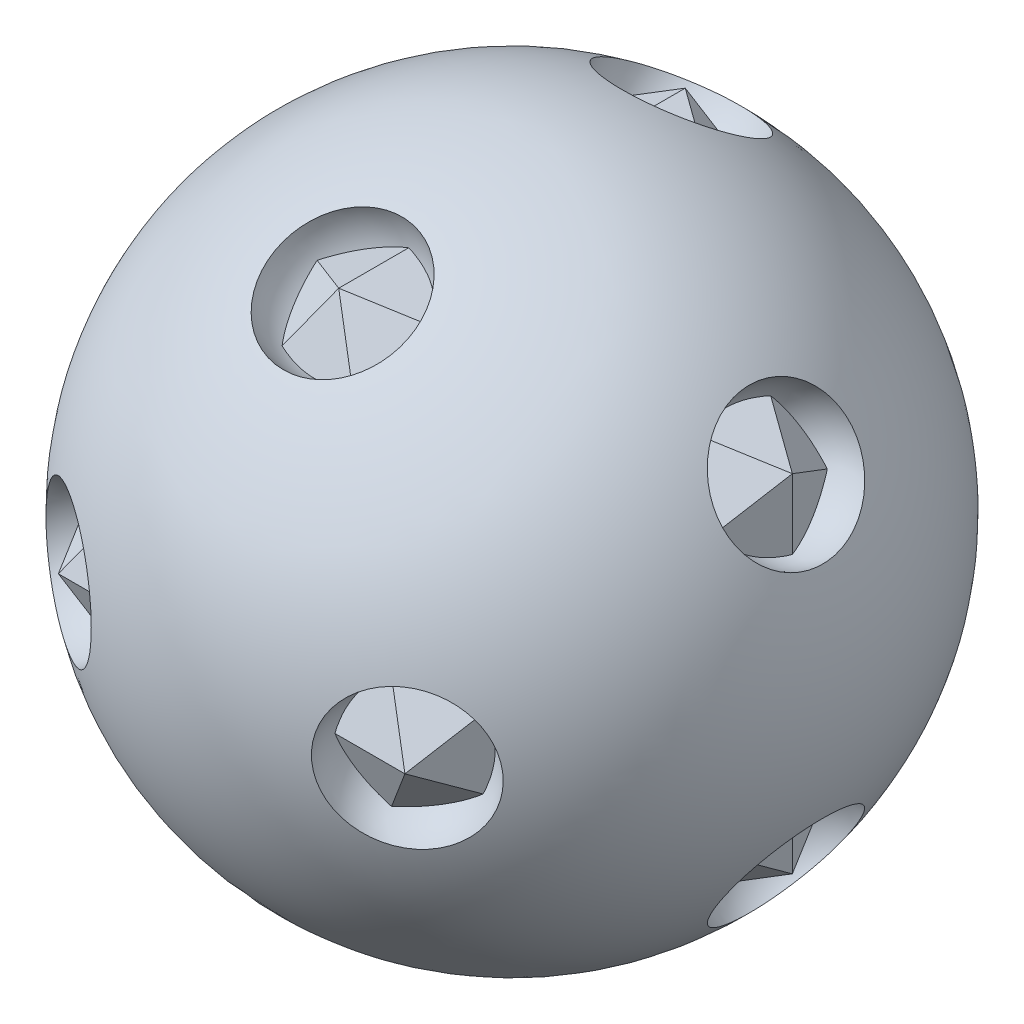
ISO-10303-21;
HEADER;
FILE_DESCRIPTION(('STEP AP214'),'2;1');
FILE_NAME('part.step','',(''),(''),'','','');
FILE_SCHEMA(('AUTOMOTIVE_DESIGN { 1 0 10303 214 1 1 1 1 }'));
ENDSEC;
DATA;
#1=APPLICATION_CONTEXT('core data for automotive mechanical design processes');
#2=APPLICATION_PROTOCOL_DEFINITION('international standard','automotive_design',2000,#1);
#3=PRODUCT_CONTEXT('',#1,'mechanical');
#4=PRODUCT('Part','Part','',(#3));
#5=PRODUCT_RELATED_PRODUCT_CATEGORY('part','',(#4));
#6=PRODUCT_DEFINITION_FORMATION('','',#4);
#7=PRODUCT_DEFINITION_CONTEXT('part definition',#1,'design');
#8=PRODUCT_DEFINITION('design','',#6,#7);
#9=PRODUCT_DEFINITION_SHAPE('','',#8);
#10=(LENGTH_UNIT() NAMED_UNIT(*) SI_UNIT(.MILLI.,.METRE.));
#11=(NAMED_UNIT(*) PLANE_ANGLE_UNIT() SI_UNIT($,.RADIAN.));
#12=(NAMED_UNIT(*) SI_UNIT($,.STERADIAN.) SOLID_ANGLE_UNIT());
#13=UNCERTAINTY_MEASURE_WITH_UNIT(LENGTH_MEASURE(1.E-05),#10,'distance_accuracy_value','');
#14=(GEOMETRIC_REPRESENTATION_CONTEXT(3) GLOBAL_UNCERTAINTY_ASSIGNED_CONTEXT((#13)) GLOBAL_UNIT_ASSIGNED_CONTEXT((#10,
#11,#12)) REPRESENTATION_CONTEXT('',''));
#15=CARTESIAN_POINT('',(0.,0.,0.));
#16=DIRECTION('',(0.,0.,1.));
#17=DIRECTION('',(1.,0.,0.));
#18=AXIS2_PLACEMENT_3D('',#15,#16,#17);
#19=CARTESIAN_POINT('',(-558.012701892219,0.,100.));
#20=DIRECTION('',(0.,-0.356822089773091,-0.934172358962715));
#21=DIRECTION('',(0.,0.934172358962715,-0.356822089773091));
#22=AXIS2_PLACEMENT_3D('',#19,#20,#21);
#23=PLANE('',#22);
#24=DIRECTION('',(0.500000000000004,-0.809016994374945,0.309016994374947));
#25=VECTOR('',#24,1.);
#26=CARTESIAN_POINT('',(-93.1506263168149,250.720879453945,4.23314573785789));
#27=LINE('',#26,#25);
#28=CARTESIAN_POINT('',(0.,100.,61.8033988749895));
#29=VERTEX_POINT('',#28);
#30=CARTESIAN_POINT('',(61.8033988749896,-1.12410081243297E-12,99.9999999999998));
#31=VERTEX_POINT('',#30);
#32=EDGE_CURVE('E98',#29,#31,#27,.T.);
#33=ORIENTED_EDGE('',*,*,#32,.F.);
#34=DIRECTION('',(-0.500000000000004,-0.809016994374945,0.309016994374947));
#35=VECTOR('',#34,1.);
#36=CARTESIAN_POINT('',(-185.8557246293,-200.720879453944,176.668553699636));
#37=LINE('',#36,#35);
#38=CARTESIAN_POINT('',(-61.8033988749895,8.64759652774438E-13,100.));
#39=VERTEX_POINT('',#38);
#40=EDGE_CURVE('E100',#29,#39,#37,.T.);
#41=ORIENTED_EDGE('',*,*,#40,.T.);
#42=DIRECTION('',(1.,0.,0.));
#43=VECTOR('',#42,1.);
#44=CARTESIAN_POINT('',(-558.012701892219,0.,100.));
#45=LINE('',#44,#43);
#46=EDGE_CURVE('E102',#39,#31,#45,.T.);
#47=ORIENTED_EDGE('',*,*,#46,.T.);
#48=EDGE_LOOP('',(#33,#41,#47));
#49=FACE_BOUND('',#48,.T.);
#50=ADVANCED_FACE('F43',(#49),#23,.F.);
#51=CARTESIAN_POINT('',(-24.6069014801713,33.0057977575851,153.404502597577));
#52=DIRECTION('',(0.577350269189626,0.577350269189629,0.577350269189623));
#53=DIRECTION('',(-0.70710678118655,0.707106781186545,0.));
#54=AXIS2_PLACEMENT_3D('',#51,#52,#53);
#55=PLANE('',#54);
#56=ORIENTED_EDGE('',*,*,#32,.T.);
#57=DIRECTION('',(-0.309016994374949,-0.499999999999994,0.80901699437495));
#58=VECTOR('',#57,1.);
#59=CARTESIAN_POINT('',(171.330416410575,177.218437058981,-186.745454594568));
#60=LINE('',#59,#58);
#61=CARTESIAN_POINT('',(99.9999999999999,61.8033988749896,0.));
#62=VERTEX_POINT('',#61);
#63=EDGE_CURVE('E119',#62,#31,#60,.T.);
#64=ORIENTED_EDGE('',*,*,#63,.F.);
#65=DIRECTION('',(0.809016994374947,-0.309016994374947,-0.5));
#66=VECTOR('',#65,1.);
#67=CARTESIAN_POINT('',(-86.4103003551607,133.005797757584,115.207901472566));
#68=LINE('',#67,#66);
#69=EDGE_CURVE('E117',#29,#62,#68,.T.);
#70=ORIENTED_EDGE('',*,*,#69,.F.);
#71=EDGE_LOOP('',(#56,#64,#70));
#72=FACE_BOUND('',#71,.T.);
#73=ADVANCED_FACE('F118',(#72),#55,.T.);
#74=CARTESIAN_POINT('',(24.6069014801713,33.0057977575851,153.404502597577));
#75=DIRECTION('',(0.577350269189626,-0.577350269189629,-0.577350269189623));
#76=DIRECTION('',(0.70710678118655,0.707106781186545,0.));
#77=AXIS2_PLACEMENT_3D('',#74,#75,#76);
#78=PLANE('',#77);
#79=DIRECTION('',(-0.809016994374947,-0.309016994374947,-0.5));
#80=VECTOR('',#79,1.);
#81=CARTESIAN_POINT('',(86.4103003551607,133.005797757584,115.207901472566));
#82=LINE('',#81,#80);
#83=CARTESIAN_POINT('',(-100.,61.8033988749895,1.07552855510562E-13));
#84=VERTEX_POINT('',#83);
#85=EDGE_CURVE('E111',#29,#84,#82,.T.);
#86=ORIENTED_EDGE('',*,*,#85,.T.);
#87=DIRECTION('',(-0.309016994374949,0.499999999999994,-0.80901699437495));
#88=VECTOR('',#87,1.);
#89=CARTESIAN_POINT('',(-169.291429402767,173.919286777729,-181.407317305508));
#90=LINE('',#89,#88);
#91=EDGE_CURVE('E113',#39,#84,#90,.T.);
#92=ORIENTED_EDGE('',*,*,#91,.F.);
#93=ORIENTED_EDGE('',*,*,#40,.F.);
#94=EDGE_LOOP('',(#86,#92,#93));
#95=FACE_BOUND('',#94,.T.);
#96=ADVANCED_FACE('F109',(#95),#78,.F.);
#97=CARTESIAN_POINT('',(24.6069014801713,-33.0057977575851,153.404502597577));
#98=DIRECTION('',(-0.577350269189626,-0.577350269189629,0.577350269189623));
#99=DIRECTION('',(0.70710678118655,-0.707106781186545,0.));
#100=AXIS2_PLACEMENT_3D('',#97,#98,#99);
#101=PLANE('',#100);
#102=DIRECTION('',(-0.309016994374949,-0.499999999999994,-0.80901699437495));
#103=VECTOR('',#102,1.);
#104=CARTESIAN_POINT('',(-11.6102700347279,81.2141884652437,231.407317305508));
#105=LINE('',#104,#103);
#106=CARTESIAN_POINT('',(-99.9999999999999,-61.8033988749896,0.));
#107=VERTEX_POINT('',#106);
#108=EDGE_CURVE('E359',#39,#107,#105,.T.);
#109=ORIENTED_EDGE('',*,*,#108,.T.);
#110=DIRECTION('',(-0.809016994374947,0.309016994374947,-0.5));
#111=VECTOR('',#110,1.);
#112=CARTESIAN_POINT('',(86.4103003551607,-133.005797757584,115.207901472566));
#113=LINE('',#112,#111);
#114=CARTESIAN_POINT('',(0.,-100.,61.8033988749895));
#115=VERTEX_POINT('',#114);
#116=EDGE_CURVE('E361',#115,#107,#113,.T.);
#117=ORIENTED_EDGE('',*,*,#116,.F.);
#118=DIRECTION('',(0.500000000000004,-0.809016994374945,-0.309016994374947));
#119=VECTOR('',#118,1.);
#120=CARTESIAN_POINT('',(-185.8557246293,200.720879453944,176.668553699636));
#121=LINE('',#120,#119);
#122=EDGE_CURVE('E363',#39,#115,#121,.T.);
#123=ORIENTED_EDGE('',*,*,#122,.F.);
#124=EDGE_LOOP('',(#109,#117,#123));
#125=FACE_BOUND('',#124,.T.);
#126=ADVANCED_FACE('F321',(#125),#101,.T.);
#127=CARTESIAN_POINT('',(-558.012701892219,0.,100.));
#128=DIRECTION('',(0.,-0.356822089773091,0.934172358962715));
#129=DIRECTION('',(0.,-0.934172358962715,-0.356822089773091));
#130=AXIS2_PLACEMENT_3D('',#127,#128,#129);
#131=PLANE('',#130);
#132=ORIENTED_EDGE('',*,*,#46,.F.);
#133=ORIENTED_EDGE('',*,*,#122,.T.);
#134=DIRECTION('',(-0.500000000000004,-0.809016994374945,-0.309016994374947));
#135=VECTOR('',#134,1.);
#136=CARTESIAN_POINT('',(-93.1506263168149,-250.720879453945,4.23314573785789));
#137=LINE('',#136,#135);
#138=EDGE_CURVE('E371',#31,#115,#137,.T.);
#139=ORIENTED_EDGE('',*,*,#138,.F.);
#140=EDGE_LOOP('',(#132,#133,#139));
#141=FACE_BOUND('',#140,.T.);
#142=ADVANCED_FACE('F311',(#141),#131,.T.);
#143=CARTESIAN_POINT('',(-24.6069014801713,-33.0057977575851,153.404502597577));
#144=DIRECTION('',(-0.577350269189626,0.577350269189629,-0.577350269189623));
#145=DIRECTION('',(-0.70710678118655,-0.707106781186545,0.));
#146=AXIS2_PLACEMENT_3D('',#143,#144,#145);
#147=PLANE('',#146);
#148=DIRECTION('',(-0.309016994374949,0.499999999999994,0.80901699437495));
#149=VECTOR('',#148,1.);
#150=CARTESIAN_POINT('',(9.57128302691999,84.5133387464962,236.745454594568));
#151=LINE('',#150,#149);
#152=CARTESIAN_POINT('',(99.9999999999999,-61.8033988749896,0.));
#153=VERTEX_POINT('',#152);
#154=EDGE_CURVE('E374',#153,#31,#151,.T.);
#155=ORIENTED_EDGE('',*,*,#154,.T.);
#156=ORIENTED_EDGE('',*,*,#138,.T.);
#157=DIRECTION('',(0.809016994374947,0.309016994374947,-0.5));
#158=VECTOR('',#157,1.);
#159=CARTESIAN_POINT('',(-86.4103003551607,-133.005797757584,115.207901472566));
#160=LINE('',#159,#158);
#161=EDGE_CURVE('E160',#115,#153,#160,.T.);
#162=ORIENTED_EDGE('',*,*,#161,.T.);
#163=EDGE_LOOP('',(#155,#156,#162));
#164=FACE_BOUND('',#163,.T.);
#165=ADVANCED_FACE('F302',(#164),#147,.F.);
#166=CARTESIAN_POINT('',(100.,523.463551610967,0.));
#167=DIRECTION('',(0.934172358962716,0.,0.35682208977309));
#168=DIRECTION('',(0.35682208977309,0.,-0.934172358962716));
#169=AXIS2_PLACEMENT_3D('',#166,#167,#168);
#170=PLANE('',#169);
#171=ORIENTED_EDGE('',*,*,#154,.F.);
#172=DIRECTION('',(0.,-1.,0.));
#173=VECTOR('',#172,1.);
#174=CARTESIAN_POINT('',(100.,523.463551610967,0.));
#175=LINE('',#174,#173);
#176=EDGE_CURVE('E157',#62,#153,#175,.T.);
#177=ORIENTED_EDGE('',*,*,#176,.F.);
#178=ORIENTED_EDGE('',*,*,#63,.T.);
#179=EDGE_LOOP('',(#171,#177,#178));
#180=FACE_BOUND('',#179,.T.);
#181=ADVANCED_FACE('F293',(#180),#170,.T.);
#182=CARTESIAN_POINT('',(100.,-61.8033988749895,558.012701892219));
#183=DIRECTION('',(0.35682208977309,-0.934172358962716,0.));
#184=DIRECTION('',(0.934172358962716,0.35682208977309,0.));
#185=AXIS2_PLACEMENT_3D('',#182,#183,#184);
#186=PLANE('',#185);
#187=ORIENTED_EDGE('',*,*,#161,.F.);
#188=DIRECTION('',(0.,0.,-1.));
#189=VECTOR('',#188,1.);
#190=CARTESIAN_POINT('',(0.,-100.,100.));
#191=LINE('',#190,#189);
#192=CARTESIAN_POINT('',(0.,-100.,-61.8033988749895));
#193=VERTEX_POINT('',#192);
#194=EDGE_CURVE('E159',#115,#193,#191,.T.);
#195=ORIENTED_EDGE('',*,*,#194,.T.);
#196=DIRECTION('',(0.809016994374947,0.309016994374947,0.5));
#197=VECTOR('',#196,1.);
#198=CARTESIAN_POINT('',(-86.4103003551607,-133.005797757584,-115.207901472566));
#199=LINE('',#198,#197);
#200=EDGE_CURVE('E151',#193,#153,#199,.T.);
#201=ORIENTED_EDGE('',*,*,#200,.T.);
#202=EDGE_LOOP('',(#187,#195,#201));
#203=FACE_BOUND('',#202,.T.);
#204=ADVANCED_FACE('F164',(#203),#186,.T.);
#205=CARTESIAN_POINT('',(-100.,-61.8033988749895,558.012701892219));
#206=DIRECTION('',(0.35682208977309,0.934172358962716,0.));
#207=DIRECTION('',(-0.934172358962716,0.35682208977309,0.));
#208=AXIS2_PLACEMENT_3D('',#205,#206,#207);
#209=PLANE('',#208);
#210=ORIENTED_EDGE('',*,*,#116,.T.);
#211=DIRECTION('',(-0.809016994374947,0.309016994374947,0.5));
#212=VECTOR('',#211,1.);
#213=CARTESIAN_POINT('',(86.4103003551607,-133.005797757584,-115.207901472566));
#214=LINE('',#213,#212);
#215=EDGE_CURVE('E167',#193,#107,#214,.T.);
#216=ORIENTED_EDGE('',*,*,#215,.F.);
#217=ORIENTED_EDGE('',*,*,#194,.F.);
#218=EDGE_LOOP('',(#210,#216,#217));
#219=FACE_BOUND('',#218,.T.);
#220=ADVANCED_FACE('F274',(#219),#209,.F.);
#221=CARTESIAN_POINT('',(-100.,510.266950485956,0.));
#222=DIRECTION('',(0.934172358962716,0.,-0.35682208977309));
#223=DIRECTION('',(-0.35682208977309,0.,-0.934172358962716));
#224=AXIS2_PLACEMENT_3D('',#221,#222,#223);
#225=PLANE('',#224);
#226=ORIENTED_EDGE('',*,*,#108,.F.);
#227=ORIENTED_EDGE('',*,*,#91,.T.);
#228=DIRECTION('',(0.,-1.,0.));
#229=VECTOR('',#228,1.);
#230=CARTESIAN_POINT('',(-100.,510.266950485956,0.));
#231=LINE('',#230,#229);
#232=EDGE_CURVE('E170',#84,#107,#231,.T.);
#233=ORIENTED_EDGE('',*,*,#232,.T.);
#234=EDGE_LOOP('',(#226,#227,#233));
#235=FACE_BOUND('',#234,.T.);
#236=ADVANCED_FACE('F264',(#235),#225,.F.);
#237=CARTESIAN_POINT('',(-100.,510.266950485956,0.));
#238=DIRECTION('',(-0.934172358962716,0.,-0.35682208977309));
#239=DIRECTION('',(-0.35682208977309,0.,0.934172358962716));
#240=AXIS2_PLACEMENT_3D('',#237,#238,#239);
#241=PLANE('',#240);
#242=ORIENTED_EDGE('',*,*,#232,.F.);
#243=DIRECTION('',(0.309016994374949,-0.499999999999994,-0.80901699437495));
#244=VECTOR('',#243,1.);
#245=CARTESIAN_POINT('',(-169.291429402767,173.919286777729,181.407317305508));
#246=LINE('',#245,#244);
#247=CARTESIAN_POINT('',(-61.8033988749895,-8.60422844084496E-13,-100.));
#248=VERTEX_POINT('',#247);
#249=EDGE_CURVE('E176',#84,#248,#246,.T.);
#250=ORIENTED_EDGE('',*,*,#249,.T.);
#251=DIRECTION('',(0.309016994374949,0.499999999999994,-0.80901699437495));
#252=VECTOR('',#251,1.);
#253=CARTESIAN_POINT('',(-11.6102700347279,81.2141884652437,-231.407317305508));
#254=LINE('',#253,#252);
#255=EDGE_CURVE('E178',#107,#248,#254,.T.);
#256=ORIENTED_EDGE('',*,*,#255,.F.);
#257=EDGE_LOOP('',(#242,#250,#256));
#258=FACE_BOUND('',#257,.T.);
#259=ADVANCED_FACE('F255',(#258),#241,.T.);
#260=CARTESIAN_POINT('',(24.6069014801713,-33.0057977575851,-153.404502597577));
#261=DIRECTION('',(0.577350269189626,0.577350269189629,0.577350269189623));
#262=DIRECTION('',(-0.70710678118655,0.707106781186545,0.));
#263=AXIS2_PLACEMENT_3D('',#260,#261,#262);
#264=PLANE('',#263);
#265=ORIENTED_EDGE('',*,*,#215,.T.);
#266=ORIENTED_EDGE('',*,*,#255,.T.);
#267=DIRECTION('',(-0.500000000000004,0.809016994374945,-0.309016994374947));
#268=VECTOR('',#267,1.);
#269=CARTESIAN_POINT('',(-185.8557246293,200.720879453944,-176.668553699636));
#270=LINE('',#269,#268);
#271=EDGE_CURVE('E181',#193,#248,#270,.T.);
#272=ORIENTED_EDGE('',*,*,#271,.F.);
#273=EDGE_LOOP('',(#265,#266,#272));
#274=FACE_BOUND('',#273,.T.);
#275=ADVANCED_FACE('F246',(#274),#264,.F.);
#276=CARTESIAN_POINT('',(24.6069014801713,33.0057977575851,-153.404502597577));
#277=DIRECTION('',(-0.577350269189626,0.577350269189629,-0.577350269189623));
#278=DIRECTION('',(-0.70710678118655,-0.707106781186545,0.));
#279=AXIS2_PLACEMENT_3D('',#276,#277,#278);
#280=PLANE('',#279);
#281=ORIENTED_EDGE('',*,*,#249,.F.);
#282=DIRECTION('',(-0.809016994374947,-0.309016994374947,0.5));
#283=VECTOR('',#282,1.);
#284=CARTESIAN_POINT('',(86.4103003551607,133.005797757584,-115.207901472566));
#285=LINE('',#284,#283);
#286=CARTESIAN_POINT('',(0.,100.,-61.8033988749895));
#287=VERTEX_POINT('',#286);
#288=EDGE_CURVE('E66',#287,#84,#285,.T.);
#289=ORIENTED_EDGE('',*,*,#288,.F.);
#290=DIRECTION('',(0.500000000000004,0.809016994374945,0.309016994374947));
#291=VECTOR('',#290,1.);
#292=CARTESIAN_POINT('',(-185.8557246293,-200.720879453944,-176.668553699636));
#293=LINE('',#292,#291);
#294=EDGE_CURVE('E133',#248,#287,#293,.T.);
#295=ORIENTED_EDGE('',*,*,#294,.F.);
#296=EDGE_LOOP('',(#281,#289,#295));
#297=FACE_BOUND('',#296,.T.);
#298=ADVANCED_FACE('F186',(#297),#280,.T.);
#299=CARTESIAN_POINT('',(-100.,61.8033988749895,558.012701892219));
#300=DIRECTION('',(-0.35682208977309,0.934172358962716,0.));
#301=DIRECTION('',(-0.934172358962716,-0.35682208977309,0.));
#302=AXIS2_PLACEMENT_3D('',#299,#300,#301);
#303=PLANE('',#302);
#304=ORIENTED_EDGE('',*,*,#85,.F.);
#305=DIRECTION('',(0.,0.,-1.));
#306=VECTOR('',#305,1.);
#307=CARTESIAN_POINT('',(0.,100.,558.012701892219));
#308=LINE('',#307,#306);
#309=EDGE_CURVE('E128',#29,#287,#308,.T.);
#310=ORIENTED_EDGE('',*,*,#309,.T.);
#311=ORIENTED_EDGE('',*,*,#288,.T.);
#312=EDGE_LOOP('',(#304,#310,#311));
#313=FACE_BOUND('',#312,.T.);
#314=ADVANCED_FACE('F127',(#313),#303,.T.);
#315=CARTESIAN_POINT('',(100.,61.8033988749895,558.012701892219));
#316=DIRECTION('',(-0.35682208977309,-0.934172358962716,0.));
#317=DIRECTION('',(0.934172358962716,-0.35682208977309,0.));
#318=AXIS2_PLACEMENT_3D('',#315,#316,#317);
#319=PLANE('',#318);
#320=ORIENTED_EDGE('',*,*,#69,.T.);
#321=DIRECTION('',(0.809016994374947,-0.309016994374947,0.5));
#322=VECTOR('',#321,1.);
#323=CARTESIAN_POINT('',(-86.4103003551607,133.005797757584,-115.207901472566));
#324=LINE('',#323,#322);
#325=EDGE_CURVE('E132',#287,#62,#324,.T.);
#326=ORIENTED_EDGE('',*,*,#325,.F.);
#327=ORIENTED_EDGE('',*,*,#309,.F.);
#328=EDGE_LOOP('',(#320,#326,#327));
#329=FACE_BOUND('',#328,.T.);
#330=ADVANCED_FACE('F130',(#329),#319,.F.);
#331=CARTESIAN_POINT('',(-24.6069014801713,33.0057977575851,-153.404502597577));
#332=DIRECTION('',(-0.577350269189626,-0.577350269189629,0.577350269189623));
#333=DIRECTION('',(0.70710678118655,-0.707106781186545,0.));
#334=AXIS2_PLACEMENT_3D('',#331,#332,#333);
#335=PLANE('',#334);
#336=DIRECTION('',(-0.500000000000004,0.809016994374945,0.309016994374947));
#337=VECTOR('',#336,1.);
#338=CARTESIAN_POINT('',(-93.1506263168149,250.720879453945,-4.23314573785789));
#339=LINE('',#338,#337);
#340=CARTESIAN_POINT('',(61.8033988749895,0.,-100.));
#341=VERTEX_POINT('',#340);
#342=EDGE_CURVE('E58',#341,#287,#339,.T.);
#343=ORIENTED_EDGE('',*,*,#342,.T.);
#344=ORIENTED_EDGE('',*,*,#325,.T.);
#345=DIRECTION('',(0.309016994374949,0.499999999999994,0.80901699437495));
#346=VECTOR('',#345,1.);
#347=CARTESIAN_POINT('',(171.330416410575,177.218437058981,186.745454594568));
#348=LINE('',#347,#346);
#349=EDGE_CURVE('E140',#341,#62,#348,.T.);
#350=ORIENTED_EDGE('',*,*,#349,.F.);
#351=EDGE_LOOP('',(#343,#344,#350));
#352=FACE_BOUND('',#351,.T.);
#353=ADVANCED_FACE('F189',(#352),#335,.F.);
#354=CARTESIAN_POINT('',(-558.012701892219,0.,-100.));
#355=DIRECTION('',(0.,0.356822089773091,-0.934172358962715));
#356=DIRECTION('',(0.,0.934172358962715,0.356822089773091));
#357=AXIS2_PLACEMENT_3D('',#354,#355,#356);
#358=PLANE('',#357);
#359=DIRECTION('',(1.,0.,0.));
#360=VECTOR('',#359,1.);
#361=CARTESIAN_POINT('',(-100.,0.,-100.));
#362=LINE('',#361,#360);
#363=EDGE_CURVE('E143',#248,#341,#362,.T.);
#364=ORIENTED_EDGE('',*,*,#363,.F.);
#365=ORIENTED_EDGE('',*,*,#294,.T.);
#366=ORIENTED_EDGE('',*,*,#342,.F.);
#367=EDGE_LOOP('',(#364,#365,#366));
#368=FACE_BOUND('',#367,.T.);
#369=ADVANCED_FACE('F187',(#368),#358,.T.);
#370=CARTESIAN_POINT('',(100.,523.463551610967,0.));
#371=DIRECTION('',(-0.934172358962716,0.,0.35682208977309));
#372=DIRECTION('',(0.35682208977309,0.,0.934172358962716));
#373=AXIS2_PLACEMENT_3D('',#370,#371,#372);
#374=PLANE('',#373);
#375=DIRECTION('',(0.309016994374949,-0.499999999999994,0.80901699437495));
#376=VECTOR('',#375,1.);
#377=CARTESIAN_POINT('',(9.57128302691999,84.5133387464962,-236.745454594568));
#378=LINE('',#377,#376);
#379=EDGE_CURVE('E51',#341,#153,#378,.T.);
#380=ORIENTED_EDGE('',*,*,#379,.F.);
#381=ORIENTED_EDGE('',*,*,#349,.T.);
#382=ORIENTED_EDGE('',*,*,#176,.T.);
#383=EDGE_LOOP('',(#380,#381,#382));
#384=FACE_BOUND('',#383,.T.);
#385=ADVANCED_FACE('F156',(#384),#374,.F.);
#386=CARTESIAN_POINT('',(-24.6069014801713,-33.0057977575851,-153.404502597577));
#387=DIRECTION('',(0.577350269189626,-0.577350269189629,-0.577350269189623));
#388=DIRECTION('',(0.70710678118655,0.707106781186545,0.));
#389=AXIS2_PLACEMENT_3D('',#386,#387,#388);
#390=PLANE('',#389);
#391=DIRECTION('',(0.500000000000004,0.809016994374945,-0.309016994374947));
#392=VECTOR('',#391,1.);
#393=CARTESIAN_POINT('',(-93.1506263168149,-250.720879453945,-4.23314573785789));
#394=LINE('',#393,#392);
#395=EDGE_CURVE('E12',#193,#341,#394,.T.);
#396=ORIENTED_EDGE('',*,*,#395,.T.);
#397=ORIENTED_EDGE('',*,*,#379,.T.);
#398=ORIENTED_EDGE('',*,*,#200,.F.);
#399=EDGE_LOOP('',(#396,#397,#398));
#400=FACE_BOUND('',#399,.T.);
#401=ADVANCED_FACE('F149',(#400),#390,.T.);
#402=CARTESIAN_POINT('',(-558.012701892219,0.,-100.));
#403=DIRECTION('',(0.,0.356822089773091,0.934172358962715));
#404=DIRECTION('',(0.,-0.934172358962715,0.356822089773091));
#405=AXIS2_PLACEMENT_3D('',#402,#403,#404);
#406=PLANE('',#405);
#407=ORIENTED_EDGE('',*,*,#395,.F.);
#408=ORIENTED_EDGE('',*,*,#271,.T.);
#409=ORIENTED_EDGE('',*,*,#363,.T.);
#410=EDGE_LOOP('',(#407,#408,#409));
#411=FACE_BOUND('',#410,.T.);
#412=ADVANCED_FACE('F45',(#411),#406,.F.);
#413=OPEN_SHELL('',(#50,#73,#96,#126,#142,#165,#181,#204,#220,#236,#259,#275,#298,#314,#330,
#353,#369,#385,#401,#412));
#414=SHELL_BASED_SURFACE_MODEL('B2',(#413));
#415=CARTESIAN_POINT('',(0.,0.,0.));
#416=DIRECTION('',(-1.,0.,0.));
#417=DIRECTION('',(0.,1.,0.));
#418=AXIS2_PLACEMENT_3D('',#415,#416,#417);
#419=SPHERICAL_SURFACE('',#418,117.557050458495);
#420=CARTESIAN_POINT('',(-2.30587547510254E-13,-97.7387287570317,-60.4058563890515));
#421=DIRECTION('',(0.,-0.850650808352043,-0.525731112119128));
#422=DIRECTION('',(0.,0.525731112119128,-0.850650808352043));
#423=AXIS2_PLACEMENT_3D('',#420,#421,#422);
#424=CIRCLE('',#423,24.8582687926115);
#425=CARTESIAN_POINT('',(-2.30587547510254E-13,-84.6699634593358,-81.5515628317189));
#426=VERTEX_POINT('',#425);
#427=EDGE_CURVE('E390',#426,#426,#424,.F.);
#428=ORIENTED_EDGE('',*,*,#427,.T.);
#429=EDGE_LOOP('',(#428));
#430=FACE_BOUND('',#429,.T.);
#431=CARTESIAN_POINT('',(2.30587547510254E-13,97.7387287570317,60.4058563890515));
#432=DIRECTION('',(0.,0.850650808352043,0.525731112119128));
#433=DIRECTION('',(0.,-0.525731112119128,0.850650808352043));
#434=AXIS2_PLACEMENT_3D('',#431,#432,#433);
#435=CIRCLE('',#434,24.8582687926115);
#436=CARTESIAN_POINT('',(2.30587547510254E-13,84.6699634593358,81.5515628317189));
#437=VERTEX_POINT('',#436);
#438=EDGE_CURVE('E424',#437,#437,#435,.F.);
#439=ORIENTED_EDGE('',*,*,#438,.T.);
#440=EDGE_LOOP('',(#439));
#441=FACE_BOUND('',#440,.T.);
#442=CARTESIAN_POINT('',(-1.10546383071093E-12,-97.7387287570314,60.405856389052));
#443=DIRECTION('',(0.,-0.85065080835204,0.525731112119133));
#444=DIRECTION('',(0.,-0.525731112119133,-0.85065080835204));
#445=AXIS2_PLACEMENT_3D('',#442,#443,#444);
#446=CIRCLE('',#445,24.8582687926115);
#447=CARTESIAN_POINT('',(-1.10546383071093E-12,-110.807494054727,39.2601499463847));
#448=VERTEX_POINT('',#447);
#449=EDGE_CURVE('E422',#448,#448,#446,.F.);
#450=ORIENTED_EDGE('',*,*,#449,.T.);
#451=EDGE_LOOP('',(#450));
#452=FACE_BOUND('',#451,.T.);
#453=CARTESIAN_POINT('',(1.10546383071093E-12,97.7387287570314,-60.405856389052));
#454=DIRECTION('',(0.,0.85065080835204,-0.525731112119133));
#455=DIRECTION('',(0.,0.525731112119133,0.85065080835204));
#456=AXIS2_PLACEMENT_3D('',#453,#454,#455);
#457=CIRCLE('',#456,24.8582687926115);
#458=CARTESIAN_POINT('',(1.10546383071093E-12,110.807494054727,-39.2601499463847));
#459=VERTEX_POINT('',#458);
#460=EDGE_CURVE('E419',#459,#459,#457,.F.);
#461=ORIENTED_EDGE('',*,*,#460,.T.);
#462=EDGE_LOOP('',(#461));
#463=FACE_BOUND('',#462,.T.);
#464=CARTESIAN_POINT('',(97.738728757031,-60.4058563890526,6.51070722381894E-13));
#465=DIRECTION('',(0.850650808352037,-0.525731112119138,0.));
#466=DIRECTION('',(0.525731112119138,0.850650808352037,0.));
#467=AXIS2_PLACEMENT_3D('',#464,#465,#466);
#468=CIRCLE('',#467,24.8582687926115);
#469=CARTESIAN_POINT('',(110.807494054727,-39.2601499463854,6.51070722381894E-13));
#470=VERTEX_POINT('',#469);
#471=EDGE_CURVE('E416',#470,#470,#468,.F.);
#472=ORIENTED_EDGE('',*,*,#471,.T.);
#473=EDGE_LOOP('',(#472));
#474=FACE_BOUND('',#473,.T.);
#475=CARTESIAN_POINT('',(-97.738728757031,60.4058563890526,-6.51070722381894E-13));
#476=DIRECTION('',(-0.850650808352037,0.525731112119138,0.));
#477=DIRECTION('',(-0.525731112119138,-0.850650808352037,0.));
#478=AXIS2_PLACEMENT_3D('',#475,#476,#477);
#479=CIRCLE('',#478,24.8582687926115);
#480=CARTESIAN_POINT('',(-110.807494054727,39.2601499463854,-6.51070722381894E-13));
#481=VERTEX_POINT('',#480);
#482=EDGE_CURVE('E413',#481,#481,#479,.F.);
#483=ORIENTED_EDGE('',*,*,#482,.T.);
#484=EDGE_LOOP('',(#483));
#485=FACE_BOUND('',#484,.T.);
#486=CARTESIAN_POINT('',(60.4058563890525,-2.27196554164515E-13,-97.7387287570311));
#487=DIRECTION('',(0.525731112119137,0.,-0.850650808352038));
#488=DIRECTION('',(-0.850650808352038,0.,-0.525731112119137));
#489=AXIS2_PLACEMENT_3D('',#486,#487,#488);
#490=CIRCLE('',#489,24.8582687926115);
#491=CARTESIAN_POINT('',(39.2601499463853,-2.27196554164515E-13,-110.807494054727));
#492=VERTEX_POINT('',#491);
#493=EDGE_CURVE('E410',#492,#492,#490,.F.);
#494=ORIENTED_EDGE('',*,*,#493,.T.);
#495=EDGE_LOOP('',(#494));
#496=FACE_BOUND('',#495,.T.);
#497=CARTESIAN_POINT('',(-60.4058563890525,2.27196554164515E-13,97.7387287570311));
#498=DIRECTION('',(-0.525731112119137,0.,0.850650808352038));
#499=DIRECTION('',(0.850650808352038,0.,0.525731112119137));
#500=AXIS2_PLACEMENT_3D('',#497,#498,#499);
#501=CIRCLE('',#500,24.8582687926115);
#502=CARTESIAN_POINT('',(-39.2601499463853,2.27196554164515E-13,110.807494054727));
#503=VERTEX_POINT('',#502);
#504=EDGE_CURVE('E407',#503,#503,#501,.F.);
#505=ORIENTED_EDGE('',*,*,#504,.T.);
#506=EDGE_LOOP('',(#505));
#507=FACE_BOUND('',#506,.T.);
#508=CARTESIAN_POINT('',(-60.4058563890519,0.,-97.7387287570315));
#509=DIRECTION('',(-0.525731112119132,0.,-0.850650808352041));
#510=DIRECTION('',(-0.850650808352041,0.,0.525731112119132));
#511=AXIS2_PLACEMENT_3D('',#508,#509,#510);
#512=CIRCLE('',#511,24.8582687926115);
#513=CARTESIAN_POINT('',(-81.5515628317192,0.,-84.6699634593355));
#514=VERTEX_POINT('',#513);
#515=EDGE_CURVE('E404',#514,#514,#512,.F.);
#516=ORIENTED_EDGE('',*,*,#515,.T.);
#517=EDGE_LOOP('',(#516));
#518=FACE_BOUND('',#517,.T.);
#519=CARTESIAN_POINT('',(60.4058563890519,0.,97.7387287570315));
#520=DIRECTION('',(0.525731112119132,0.,0.850650808352041));
#521=DIRECTION('',(0.850650808352041,0.,-0.525731112119132));
#522=AXIS2_PLACEMENT_3D('',#519,#520,#521);
#523=CIRCLE('',#522,24.8582687926115);
#524=CARTESIAN_POINT('',(81.5515628317192,0.,84.6699634593355));
#525=VERTEX_POINT('',#524);
#526=EDGE_CURVE('E399',#525,#525,#523,.F.);
#527=ORIENTED_EDGE('',*,*,#526,.T.);
#528=EDGE_LOOP('',(#527));
#529=FACE_BOUND('',#528,.T.);
#530=CARTESIAN_POINT('',(-97.7387287570313,-60.4058563890522,0.));
#531=DIRECTION('',(-0.85065080835204,-0.525731112119134,0.));
#532=DIRECTION('',(0.525731112119134,-0.85065080835204,0.));
#533=AXIS2_PLACEMENT_3D('',#530,#531,#532);
#534=CIRCLE('',#533,24.8582687926115);
#535=CARTESIAN_POINT('',(-84.6699634593353,-81.5515628317195,0.));
#536=VERTEX_POINT('',#535);
#537=EDGE_CURVE('E394',#536,#536,#534,.F.);
#538=ORIENTED_EDGE('',*,*,#537,.T.);
#539=EDGE_LOOP('',(#538));
#540=FACE_BOUND('',#539,.T.);
#541=CARTESIAN_POINT('',(97.7387287570313,60.4058563890522,0.));
#542=DIRECTION('',(0.85065080835204,0.525731112119134,0.));
#543=DIRECTION('',(-0.525731112119134,0.85065080835204,0.));
#544=AXIS2_PLACEMENT_3D('',#541,#542,#543);
#545=CIRCLE('',#544,24.8582687926115);
#546=CARTESIAN_POINT('',(84.6699634593353,81.5515628317195,0.));
#547=VERTEX_POINT('',#546);
#548=EDGE_CURVE('E42',#547,#547,#545,.F.);
#549=ORIENTED_EDGE('',*,*,#548,.T.);
#550=EDGE_LOOP('',(#549));
#551=FACE_BOUND('',#550,.T.);
#552=ADVANCED_FACE('F387',(#430,#441,#452,#463,#474,#485,#496,#507,#518,#529,#540,#551),#419,.T.);
#553=CARTESIAN_POINT('',(99.9999999999999,61.8033988749896,0.));
#554=DIRECTION('',(0.850650808352039,0.525731112119134,0.));
#555=DIRECTION('',(-0.525731112119134,0.850650808352039,0.));
#556=AXIS2_PLACEMENT_3D('',#553,#554,#555);
#557=SPHERICAL_SURFACE('',#556,25.);
#558=ORIENTED_EDGE('',*,*,#548,.F.);
#559=EDGE_LOOP('',(#558));
#560=FACE_BOUND('',#559,.T.);
#561=ADVANCED_FACE('F443',(#560),#557,.F.);
#562=CARTESIAN_POINT('',(-99.9999999999999,-61.8033988749896,0.));
#563=DIRECTION('',(0.850650808352039,0.525731112119134,0.));
#564=DIRECTION('',(-0.525731112119134,0.850650808352039,0.));
#565=AXIS2_PLACEMENT_3D('',#562,#563,#564);
#566=SPHERICAL_SURFACE('',#565,25.);
#567=ORIENTED_EDGE('',*,*,#537,.F.);
#568=EDGE_LOOP('',(#567));
#569=FACE_BOUND('',#568,.T.);
#570=ADVANCED_FACE('F447',(#569),#566,.F.);
#571=CARTESIAN_POINT('',(61.8033988749893,0.,100.));
#572=DIRECTION('',(0.525731112119132,0.,0.850650808352041));
#573=DIRECTION('',(0.262865556059568,0.951056516295153,-0.162459848116453));
#574=AXIS2_PLACEMENT_3D('',#571,#572,#573);
#575=SPHERICAL_SURFACE('',#574,25.);
#576=ORIENTED_EDGE('',*,*,#526,.F.);
#577=EDGE_LOOP('',(#576));
#578=FACE_BOUND('',#577,.T.);
#579=ADVANCED_FACE('F452',(#578),#575,.F.);
#580=CARTESIAN_POINT('',(-61.8033988749893,0.,-100.));
#581=DIRECTION('',(0.525731112119132,0.,0.850650808352041));
#582=DIRECTION('',(0.262865556059568,0.951056516295153,-0.162459848116453));
#583=AXIS2_PLACEMENT_3D('',#580,#581,#582);
#584=SPHERICAL_SURFACE('',#583,25.);
#585=ORIENTED_EDGE('',*,*,#515,.F.);
#586=EDGE_LOOP('',(#585));
#587=FACE_BOUND('',#586,.T.);
#588=ADVANCED_FACE('F458',(#587),#584,.F.);
#589=CARTESIAN_POINT('',(-61.8033988749899,2.32452945780892E-13,99.9999999999998));
#590=DIRECTION('',(-0.525731112119137,0.,0.850650808352038));
#591=DIRECTION('',(0.688190960235587,0.587785252292471,0.425325404176022));
#592=AXIS2_PLACEMENT_3D('',#589,#590,#591);
#593=SPHERICAL_SURFACE('',#592,25.);
#594=ORIENTED_EDGE('',*,*,#504,.F.);
#595=EDGE_LOOP('',(#594));
#596=FACE_BOUND('',#595,.T.);
#597=ADVANCED_FACE('F462',(#596),#593,.F.);
#598=CARTESIAN_POINT('',(61.8033988749899,-2.32452945780892E-13,-99.9999999999998));
#599=DIRECTION('',(-0.525731112119137,0.,0.850650808352038));
#600=DIRECTION('',(0.688190960235587,0.587785252292471,0.425325404176022));
#601=AXIS2_PLACEMENT_3D('',#598,#599,#600);
#602=SPHERICAL_SURFACE('',#601,25.);
#603=ORIENTED_EDGE('',*,*,#493,.F.);
#604=EDGE_LOOP('',(#603));
#605=FACE_BOUND('',#604,.T.);
#606=ADVANCED_FACE('F466',(#605),#602,.F.);
#607=CARTESIAN_POINT('',(-99.9999999999997,61.80339887499,-6.66133814775094E-13));
#608=DIRECTION('',(-0.850650808352037,0.525731112119138,0.));
#609=DIRECTION('',(0.162459848116448,0.262865556059566,0.951056516295155));
#610=AXIS2_PLACEMENT_3D('',#607,#608,#609);
#611=SPHERICAL_SURFACE('',#610,25.);
#612=ORIENTED_EDGE('',*,*,#482,.F.);
#613=EDGE_LOOP('',(#612));
#614=FACE_BOUND('',#613,.T.);
#615=ADVANCED_FACE('F470',(#614),#611,.F.);
#616=CARTESIAN_POINT('',(99.9999999999997,-61.80339887499,6.66133814775094E-13));
#617=DIRECTION('',(-0.850650808352037,0.525731112119138,0.));
#618=DIRECTION('',(0.162459848116448,0.262865556059566,0.951056516295155));
#619=AXIS2_PLACEMENT_3D('',#616,#617,#618);
#620=SPHERICAL_SURFACE('',#619,25.);
#621=ORIENTED_EDGE('',*,*,#471,.F.);
#622=EDGE_LOOP('',(#621));
#623=FACE_BOUND('',#622,.T.);
#624=ADVANCED_FACE('F474',(#623),#620,.F.);
#625=CARTESIAN_POINT('',(1.13103970633688E-12,100.,-61.8033988749894));
#626=DIRECTION('',(0.,0.85065080835204,-0.525731112119133));
#627=DIRECTION('',(-0.587785252292477,0.425325404176023,0.688190960235581));
#628=AXIS2_PLACEMENT_3D('',#625,#626,#627);
#629=SPHERICAL_SURFACE('',#628,25.);
#630=ORIENTED_EDGE('',*,*,#460,.F.);
#631=EDGE_LOOP('',(#630));
#632=FACE_BOUND('',#631,.T.);
#633=ADVANCED_FACE('F478',(#632),#629,.F.);
#634=CARTESIAN_POINT('',(-1.13103970633688E-12,-100.,61.8033988749894));
#635=DIRECTION('',(0.,0.85065080835204,-0.525731112119133));
#636=DIRECTION('',(-0.587785252292477,0.425325404176023,0.688190960235581));
#637=AXIS2_PLACEMENT_3D('',#634,#635,#636);
#638=SPHERICAL_SURFACE('',#637,25.);
#639=ORIENTED_EDGE('',*,*,#449,.F.);
#640=EDGE_LOOP('',(#639));
#641=FACE_BOUND('',#640,.T.);
#642=ADVANCED_FACE('F439',(#641),#638,.F.);
#643=CARTESIAN_POINT('',(2.35922392732846E-13,100.,61.8033988749889));
#644=DIRECTION('',(0.,0.850650808352043,0.525731112119128));
#645=DIRECTION('',(0.951056516295153,-0.162459848116454,0.262865556059568));
#646=AXIS2_PLACEMENT_3D('',#643,#644,#645);
#647=SPHERICAL_SURFACE('',#646,25.);
#648=ORIENTED_EDGE('',*,*,#438,.F.);
#649=EDGE_LOOP('',(#648));
#650=FACE_BOUND('',#649,.T.);
#651=ADVANCED_FACE('F434',(#650),#647,.F.);
#652=CARTESIAN_POINT('',(-2.35922392732846E-13,-100.,-61.8033988749889));
#653=DIRECTION('',(0.,0.850650808352043,0.525731112119128));
#654=DIRECTION('',(0.951056516295153,-0.162459848116454,0.262865556059568));
#655=AXIS2_PLACEMENT_3D('',#652,#653,#654);
#656=SPHERICAL_SURFACE('',#655,25.);
#657=ORIENTED_EDGE('',*,*,#427,.F.);
#658=EDGE_LOOP('',(#657));
#659=FACE_BOUND('',#658,.T.);
#660=ADVANCED_FACE('F432',(#659),#656,.F.);
#661=CLOSED_SHELL('',(#552,#561,#570,#579,#588,#597,#606,#615,#624,#633,#642,#651,#660));
#662=MANIFOLD_SOLID_BREP('B6',#661);
#663=ADVANCED_BREP_SHAPE_REPRESENTATION('',(#18,#662),#14);
#664=MANIFOLD_SURFACE_SHAPE_REPRESENTATION('',(#18,#414),#14);
#665=SHAPE_REPRESENTATION('',(#18),#14);
#666=SHAPE_DEFINITION_REPRESENTATION(#9,#665);
#667=SHAPE_REPRESENTATION_RELATIONSHIP('','',#665,#663);
#668=SHAPE_REPRESENTATION_RELATIONSHIP('','',#665,#664);
ENDSEC;
END-ISO-10303-21;
